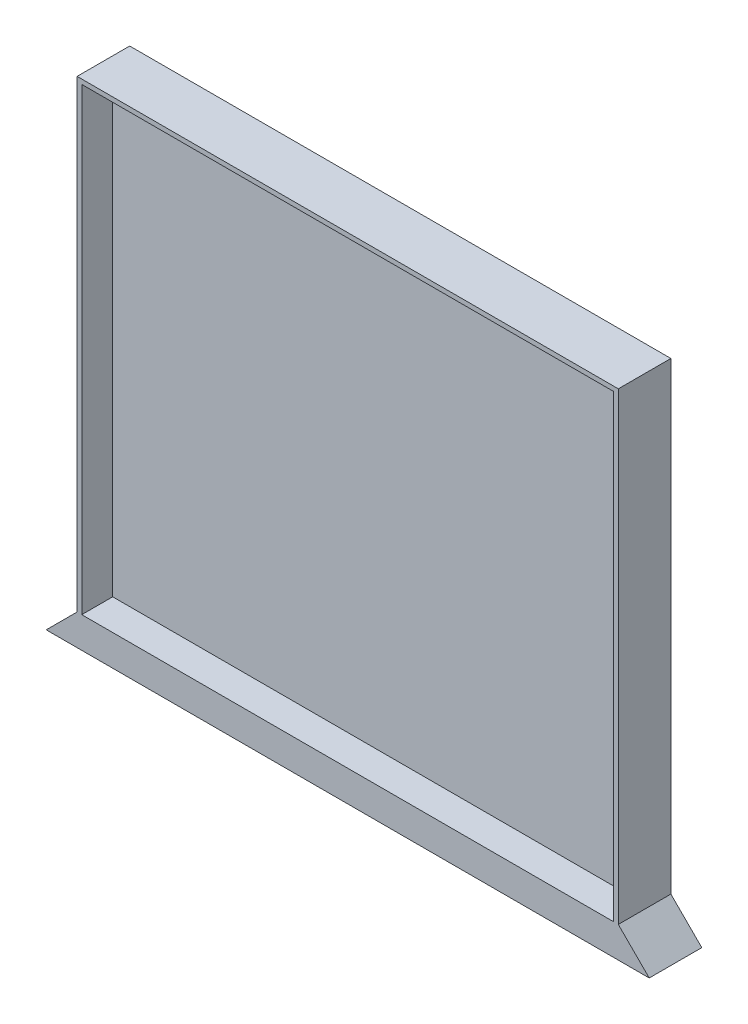
ISO-10303-21;
HEADER;
FILE_DESCRIPTION(('STEP AP214'),'2;1');
FILE_NAME('part.step','',(''),(''),'','','');
FILE_SCHEMA(('AUTOMOTIVE_DESIGN { 1 0 10303 214 1 1 1 1 }'));
ENDSEC;
DATA;
#1=APPLICATION_CONTEXT('core data for automotive mechanical design processes');
#2=APPLICATION_PROTOCOL_DEFINITION('international standard','automotive_design',2000,#1);
#3=PRODUCT_CONTEXT('',#1,'mechanical');
#4=PRODUCT('Part','Part','',(#3));
#5=PRODUCT_RELATED_PRODUCT_CATEGORY('part','',(#4));
#6=PRODUCT_DEFINITION_FORMATION('','',#4);
#7=PRODUCT_DEFINITION_CONTEXT('part definition',#1,'design');
#8=PRODUCT_DEFINITION('design','',#6,#7);
#9=PRODUCT_DEFINITION_SHAPE('','',#8);
#10=(LENGTH_UNIT() NAMED_UNIT(*) SI_UNIT(.MILLI.,.METRE.));
#11=(NAMED_UNIT(*) PLANE_ANGLE_UNIT() SI_UNIT($,.RADIAN.));
#12=(NAMED_UNIT(*) SI_UNIT($,.STERADIAN.) SOLID_ANGLE_UNIT());
#13=UNCERTAINTY_MEASURE_WITH_UNIT(LENGTH_MEASURE(1.E-05),#10,'distance_accuracy_value','');
#14=(GEOMETRIC_REPRESENTATION_CONTEXT(3) GLOBAL_UNCERTAINTY_ASSIGNED_CONTEXT((#13)) GLOBAL_UNIT_ASSIGNED_CONTEXT((#10,
#11,#12)) REPRESENTATION_CONTEXT('',''));
#15=CARTESIAN_POINT('',(0.,0.,0.));
#16=DIRECTION('',(0.,0.,1.));
#17=DIRECTION('',(1.,0.,0.));
#18=AXIS2_PLACEMENT_3D('',#15,#16,#17);
#19=CARTESIAN_POINT('',(175.,160.,34.));
#20=DIRECTION('',(-1.,0.,0.));
#21=DIRECTION('',(0.,0.,1.));
#22=AXIS2_PLACEMENT_3D('',#19,#20,#21);
#23=PLANE('',#22);
#24=DIRECTION('',(0.,0.,1.));
#25=VECTOR('',#24,1.);
#26=CARTESIAN_POINT('',(175.,-140.,34.));
#27=LINE('',#26,#25);
#28=CARTESIAN_POINT('',(175.,-140.,0.));
#29=VERTEX_POINT('',#28);
#30=CARTESIAN_POINT('',(175.,-140.,34.));
#31=VERTEX_POINT('',#30);
#32=EDGE_CURVE('E56',#29,#31,#27,.T.);
#33=ORIENTED_EDGE('',*,*,#32,.F.);
#34=DIRECTION('',(0.,1.,0.));
#35=VECTOR('',#34,1.);
#36=CARTESIAN_POINT('',(175.,160.,0.));
#37=LINE('',#36,#35);
#38=CARTESIAN_POINT('',(175.,160.,0.));
#39=VERTEX_POINT('',#38);
#40=EDGE_CURVE('E161',#29,#39,#37,.T.);
#41=ORIENTED_EDGE('',*,*,#40,.T.);
#42=DIRECTION('',(0.,0.,-1.));
#43=VECTOR('',#42,1.);
#44=CARTESIAN_POINT('',(175.,160.,34.));
#45=LINE('',#44,#43);
#46=CARTESIAN_POINT('',(175.,160.,34.));
#47=VERTEX_POINT('',#46);
#48=EDGE_CURVE('E178',#47,#39,#45,.T.);
#49=ORIENTED_EDGE('',*,*,#48,.F.);
#50=DIRECTION('',(0.,1.,0.));
#51=VECTOR('',#50,1.);
#52=CARTESIAN_POINT('',(175.,160.,34.));
#53=LINE('',#52,#51);
#54=EDGE_CURVE('E164',#31,#47,#53,.T.);
#55=ORIENTED_EDGE('',*,*,#54,.F.);
#56=EDGE_LOOP('',(#33,#41,#49,#55));
#57=FACE_BOUND('',#56,.T.);
#58=ADVANCED_FACE('F35',(#57),#23,.F.);
#59=CARTESIAN_POINT('',(-175.,160.,34.));
#60=DIRECTION('',(1.,0.,0.));
#61=DIRECTION('',(0.,1.,0.));
#62=AXIS2_PLACEMENT_3D('',#59,#60,#61);
#63=PLANE('',#62);
#64=DIRECTION('',(0.,0.,-1.));
#65=VECTOR('',#64,1.);
#66=CARTESIAN_POINT('',(-175.,-140.,34.));
#67=LINE('',#66,#65);
#68=CARTESIAN_POINT('',(-175.,-140.,34.));
#69=VERTEX_POINT('',#68);
#70=CARTESIAN_POINT('',(-175.,-140.,0.));
#71=VERTEX_POINT('',#70);
#72=EDGE_CURVE('E138',#69,#71,#67,.T.);
#73=ORIENTED_EDGE('',*,*,#72,.F.);
#74=DIRECTION('',(0.,-1.,0.));
#75=VECTOR('',#74,1.);
#76=CARTESIAN_POINT('',(-175.,160.,34.));
#77=LINE('',#76,#75);
#78=CARTESIAN_POINT('',(-175.,160.,34.));
#79=VERTEX_POINT('',#78);
#80=EDGE_CURVE('E122',#79,#69,#77,.T.);
#81=ORIENTED_EDGE('',*,*,#80,.F.);
#82=DIRECTION('',(0.,0.,-1.));
#83=VECTOR('',#82,1.);
#84=CARTESIAN_POINT('',(-175.,160.,34.));
#85=LINE('',#84,#83);
#86=CARTESIAN_POINT('',(-175.,160.,0.));
#87=VERTEX_POINT('',#86);
#88=EDGE_CURVE('E121',#79,#87,#85,.T.);
#89=ORIENTED_EDGE('',*,*,#88,.T.);
#90=DIRECTION('',(0.,-1.,0.));
#91=VECTOR('',#90,1.);
#92=CARTESIAN_POINT('',(-175.,160.,0.));
#93=LINE('',#92,#91);
#94=EDGE_CURVE('E172',#87,#71,#93,.T.);
#95=ORIENTED_EDGE('',*,*,#94,.T.);
#96=EDGE_LOOP('',(#73,#81,#89,#95));
#97=FACE_BOUND('',#96,.T.);
#98=ADVANCED_FACE('F192',(#97),#63,.F.);
#99=CARTESIAN_POINT('',(172.,157.,14.));
#100=DIRECTION('',(1.,0.,0.));
#101=DIRECTION('',(0.,0.,-1.));
#102=AXIS2_PLACEMENT_3D('',#99,#100,#101);
#103=PLANE('',#102);
#104=DIRECTION('',(0.,0.,-1.));
#105=VECTOR('',#104,1.);
#106=CARTESIAN_POINT('',(172.,-140.,14.));
#107=LINE('',#106,#105);
#108=CARTESIAN_POINT('',(172.,-140.,34.));
#109=VERTEX_POINT('',#108);
#110=CARTESIAN_POINT('',(172.,-140.,14.));
#111=VERTEX_POINT('',#110);
#112=EDGE_CURVE('E136',#109,#111,#107,.T.);
#113=ORIENTED_EDGE('',*,*,#112,.F.);
#114=DIRECTION('',(0.,1.,0.));
#115=VECTOR('',#114,1.);
#116=CARTESIAN_POINT('',(172.,157.,34.));
#117=LINE('',#116,#115);
#118=CARTESIAN_POINT('',(172.,157.,34.));
#119=VERTEX_POINT('',#118);
#120=EDGE_CURVE('E142',#109,#119,#117,.T.);
#121=ORIENTED_EDGE('',*,*,#120,.T.);
#122=DIRECTION('',(0.,0.,1.));
#123=VECTOR('',#122,1.);
#124=CARTESIAN_POINT('',(172.,157.,14.));
#125=LINE('',#124,#123);
#126=CARTESIAN_POINT('',(172.,157.,14.));
#127=VERTEX_POINT('',#126);
#128=EDGE_CURVE('E152',#127,#119,#125,.T.);
#129=ORIENTED_EDGE('',*,*,#128,.F.);
#130=DIRECTION('',(0.,1.,0.));
#131=VECTOR('',#130,1.);
#132=CARTESIAN_POINT('',(172.,157.,14.));
#133=LINE('',#132,#131);
#134=EDGE_CURVE('E143',#111,#127,#133,.T.);
#135=ORIENTED_EDGE('',*,*,#134,.F.);
#136=EDGE_LOOP('',(#113,#121,#129,#135));
#137=FACE_BOUND('',#136,.T.);
#138=ADVANCED_FACE('F210',(#137),#103,.F.);
#139=CARTESIAN_POINT('',(-172.,157.,14.));
#140=DIRECTION('',(-1.,0.,0.));
#141=DIRECTION('',(0.,0.,1.));
#142=AXIS2_PLACEMENT_3D('',#139,#140,#141);
#143=PLANE('',#142);
#144=DIRECTION('',(0.,0.,1.));
#145=VECTOR('',#144,1.);
#146=CARTESIAN_POINT('',(-172.,-140.,14.));
#147=LINE('',#146,#145);
#148=CARTESIAN_POINT('',(-172.,-140.,14.));
#149=VERTEX_POINT('',#148);
#150=CARTESIAN_POINT('',(-172.,-140.,34.));
#151=VERTEX_POINT('',#150);
#152=EDGE_CURVE('E134',#149,#151,#147,.T.);
#153=ORIENTED_EDGE('',*,*,#152,.F.);
#154=DIRECTION('',(0.,-1.,0.));
#155=VECTOR('',#154,1.);
#156=CARTESIAN_POINT('',(-172.,157.,14.));
#157=LINE('',#156,#155);
#158=CARTESIAN_POINT('',(-172.,157.,14.));
#159=VERTEX_POINT('',#158);
#160=EDGE_CURVE('E149',#159,#149,#157,.T.);
#161=ORIENTED_EDGE('',*,*,#160,.F.);
#162=DIRECTION('',(0.,0.,1.));
#163=VECTOR('',#162,1.);
#164=CARTESIAN_POINT('',(-172.,157.,14.));
#165=LINE('',#164,#163);
#166=CARTESIAN_POINT('',(-172.,157.,34.));
#167=VERTEX_POINT('',#166);
#168=EDGE_CURVE('E159',#159,#167,#165,.T.);
#169=ORIENTED_EDGE('',*,*,#168,.T.);
#170=DIRECTION('',(0.,-1.,0.));
#171=VECTOR('',#170,1.);
#172=CARTESIAN_POINT('',(-172.,157.,34.));
#173=LINE('',#172,#171);
#174=EDGE_CURVE('E146',#167,#151,#173,.T.);
#175=ORIENTED_EDGE('',*,*,#174,.T.);
#176=EDGE_LOOP('',(#153,#161,#169,#175));
#177=FACE_BOUND('',#176,.T.);
#178=ADVANCED_FACE('F227',(#177),#143,.F.);
#179=CARTESIAN_POINT('',(0.,0.,14.));
#180=DIRECTION('',(0.,0.,1.));
#181=DIRECTION('',(1.,0.,0.));
#182=AXIS2_PLACEMENT_3D('',#179,#180,#181);
#183=PLANE('',#182);
#184=ORIENTED_EDGE('',*,*,#160,.T.);
#185=DIRECTION('',(1.,0.,0.));
#186=VECTOR('',#185,1.);
#187=CARTESIAN_POINT('',(0.,-140.,14.));
#188=LINE('',#187,#186);
#189=EDGE_CURVE('E181',#149,#111,#188,.T.);
#190=ORIENTED_EDGE('',*,*,#189,.T.);
#191=ORIENTED_EDGE('',*,*,#134,.T.);
#192=DIRECTION('',(-1.,0.,0.));
#193=VECTOR('',#192,1.);
#194=CARTESIAN_POINT('',(-172.,157.,14.));
#195=LINE('',#194,#193);
#196=EDGE_CURVE('E145',#127,#159,#195,.T.);
#197=ORIENTED_EDGE('',*,*,#196,.T.);
#198=EDGE_LOOP('',(#184,#190,#191,#197));
#199=FACE_BOUND('',#198,.T.);
#200=ADVANCED_FACE('F215',(#199),#183,.T.);
#201=CARTESIAN_POINT('',(-175.,160.,34.));
#202=DIRECTION('',(0.,-1.,0.));
#203=DIRECTION('',(0.,0.,-1.));
#204=AXIS2_PLACEMENT_3D('',#201,#202,#203);
#205=PLANE('',#204);
#206=DIRECTION('',(-1.,0.,0.));
#207=VECTOR('',#206,1.);
#208=CARTESIAN_POINT('',(-175.,160.,0.));
#209=LINE('',#208,#207);
#210=EDGE_CURVE('E170',#39,#87,#209,.T.);
#211=ORIENTED_EDGE('',*,*,#210,.T.);
#212=ORIENTED_EDGE('',*,*,#88,.F.);
#213=DIRECTION('',(-1.,0.,0.));
#214=VECTOR('',#213,1.);
#215=CARTESIAN_POINT('',(-175.,160.,34.));
#216=LINE('',#215,#214);
#217=EDGE_CURVE('E166',#47,#79,#216,.T.);
#218=ORIENTED_EDGE('',*,*,#217,.F.);
#219=ORIENTED_EDGE('',*,*,#48,.T.);
#220=EDGE_LOOP('',(#211,#212,#218,#219));
#221=FACE_BOUND('',#220,.T.);
#222=ADVANCED_FACE('F213',(#221),#205,.F.);
#223=CARTESIAN_POINT('',(-175.,-160.,34.));
#224=DIRECTION('',(0.,1.,0.));
#225=DIRECTION('',(0.,0.,1.));
#226=AXIS2_PLACEMENT_3D('',#223,#224,#225);
#227=PLANE('',#226);
#228=DIRECTION('',(1.,0.,0.));
#229=VECTOR('',#228,1.);
#230=CARTESIAN_POINT('',(-175.,-160.,0.));
#231=LINE('',#230,#229);
#232=CARTESIAN_POINT('',(-195.,-160.,0.));
#233=VERTEX_POINT('',#232);
#234=CARTESIAN_POINT('',(195.,-160.,0.));
#235=VERTEX_POINT('',#234);
#236=EDGE_CURVE('E127',#233,#235,#231,.T.);
#237=ORIENTED_EDGE('',*,*,#236,.T.);
#238=DIRECTION('',(0.,0.,1.));
#239=VECTOR('',#238,1.);
#240=CARTESIAN_POINT('',(195.,-160.,34.));
#241=LINE('',#240,#239);
#242=CARTESIAN_POINT('',(195.,-160.,34.));
#243=VERTEX_POINT('',#242);
#244=EDGE_CURVE('E111',#235,#243,#241,.T.);
#245=ORIENTED_EDGE('',*,*,#244,.T.);
#246=DIRECTION('',(1.,0.,0.));
#247=VECTOR('',#246,1.);
#248=CARTESIAN_POINT('',(-175.,-160.,34.));
#249=LINE('',#248,#247);
#250=CARTESIAN_POINT('',(-195.,-160.,34.));
#251=VERTEX_POINT('',#250);
#252=EDGE_CURVE('E114',#251,#243,#249,.T.);
#253=ORIENTED_EDGE('',*,*,#252,.F.);
#254=DIRECTION('',(0.,0.,-1.));
#255=VECTOR('',#254,1.);
#256=CARTESIAN_POINT('',(-195.,-160.,34.));
#257=LINE('',#256,#255);
#258=EDGE_CURVE('E128',#251,#233,#257,.T.);
#259=ORIENTED_EDGE('',*,*,#258,.T.);
#260=EDGE_LOOP('',(#237,#245,#253,#259));
#261=FACE_BOUND('',#260,.T.);
#262=ADVANCED_FACE('F125',(#261),#227,.F.);
#263=CARTESIAN_POINT('',(0.,0.,34.));
#264=DIRECTION('',(0.,0.,1.));
#265=DIRECTION('',(1.,0.,0.));
#266=AXIS2_PLACEMENT_3D('',#263,#264,#265);
#267=PLANE('',#266);
#268=DIRECTION('',(-1.,0.,0.));
#269=VECTOR('',#268,1.);
#270=CARTESIAN_POINT('',(-195.,-140.,34.));
#271=LINE('',#270,#269);
#272=EDGE_CURVE('E130',#109,#151,#271,.T.);
#273=ORIENTED_EDGE('',*,*,#272,.T.);
#274=ORIENTED_EDGE('',*,*,#174,.F.);
#275=DIRECTION('',(-1.,0.,0.));
#276=VECTOR('',#275,1.);
#277=CARTESIAN_POINT('',(-172.,157.,34.));
#278=LINE('',#277,#276);
#279=EDGE_CURVE('E154',#119,#167,#278,.T.);
#280=ORIENTED_EDGE('',*,*,#279,.F.);
#281=ORIENTED_EDGE('',*,*,#120,.F.);
#282=EDGE_LOOP('',(#273,#274,#280,#281));
#283=FACE_BOUND('',#282,.T.);
#284=ORIENTED_EDGE('',*,*,#80,.T.);
#285=DIRECTION('',(-0.707106781186549,-0.707106781186546,0.));
#286=VECTOR('',#285,1.);
#287=CARTESIAN_POINT('',(-17.4999999999995,17.4999999999996,34.));
#288=LINE('',#287,#286);
#289=EDGE_CURVE('E11',#69,#251,#288,.T.);
#290=ORIENTED_EDGE('',*,*,#289,.T.);
#291=ORIENTED_EDGE('',*,*,#252,.T.);
#292=DIRECTION('',(-0.707106781186549,0.707106781186546,0.));
#293=VECTOR('',#292,1.);
#294=CARTESIAN_POINT('',(17.4999999999995,17.4999999999996,34.));
#295=LINE('',#294,#293);
#296=EDGE_CURVE('E43',#243,#31,#295,.T.);
#297=ORIENTED_EDGE('',*,*,#296,.T.);
#298=ORIENTED_EDGE('',*,*,#54,.T.);
#299=ORIENTED_EDGE('',*,*,#217,.T.);
#300=EDGE_LOOP('',(#284,#290,#291,#297,#298,#299));
#301=FACE_BOUND('',#300,.T.);
#302=ADVANCED_FACE('F116',(#283,#301),#267,.T.);
#303=CARTESIAN_POINT('',(0.,0.,0.));
#304=DIRECTION('',(0.,0.,1.));
#305=DIRECTION('',(1.,0.,0.));
#306=AXIS2_PLACEMENT_3D('',#303,#304,#305);
#307=PLANE('',#306);
#308=ORIENTED_EDGE('',*,*,#236,.F.);
#309=DIRECTION('',(0.707106781186549,0.707106781186546,0.));
#310=VECTOR('',#309,1.);
#311=CARTESIAN_POINT('',(-195.,-160.,0.));
#312=LINE('',#311,#310);
#313=EDGE_CURVE('E112',#233,#71,#312,.T.);
#314=ORIENTED_EDGE('',*,*,#313,.T.);
#315=ORIENTED_EDGE('',*,*,#94,.F.);
#316=ORIENTED_EDGE('',*,*,#210,.F.);
#317=ORIENTED_EDGE('',*,*,#40,.F.);
#318=DIRECTION('',(0.707106781186549,-0.707106781186546,0.));
#319=VECTOR('',#318,1.);
#320=CARTESIAN_POINT('',(195.,-160.,0.));
#321=LINE('',#320,#319);
#322=EDGE_CURVE('E184',#29,#235,#321,.T.);
#323=ORIENTED_EDGE('',*,*,#322,.T.);
#324=EDGE_LOOP('',(#308,#314,#315,#316,#317,#323));
#325=FACE_BOUND('',#324,.T.);
#326=ADVANCED_FACE('F188',(#325),#307,.F.);
#327=CARTESIAN_POINT('',(-172.,157.,14.));
#328=DIRECTION('',(0.,1.,0.));
#329=DIRECTION('',(0.,0.,1.));
#330=AXIS2_PLACEMENT_3D('',#327,#328,#329);
#331=PLANE('',#330);
#332=ORIENTED_EDGE('',*,*,#279,.T.);
#333=ORIENTED_EDGE('',*,*,#168,.F.);
#334=ORIENTED_EDGE('',*,*,#196,.F.);
#335=ORIENTED_EDGE('',*,*,#128,.T.);
#336=EDGE_LOOP('',(#332,#333,#334,#335));
#337=FACE_BOUND('',#336,.T.);
#338=ADVANCED_FACE('F202',(#337),#331,.F.);
#339=CARTESIAN_POINT('',(0.,-140.,0.));
#340=DIRECTION('',(0.,-1.,0.));
#341=DIRECTION('',(0.,0.,-1.));
#342=AXIS2_PLACEMENT_3D('',#339,#340,#341);
#343=PLANE('',#342);
#344=ORIENTED_EDGE('',*,*,#272,.F.);
#345=ORIENTED_EDGE('',*,*,#112,.T.);
#346=ORIENTED_EDGE('',*,*,#189,.F.);
#347=ORIENTED_EDGE('',*,*,#152,.T.);
#348=EDGE_LOOP('',(#344,#345,#346,#347));
#349=FACE_BOUND('',#348,.T.);
#350=ADVANCED_FACE('F197',(#349),#343,.F.);
#351=CARTESIAN_POINT('',(-195.,-160.,34.));
#352=DIRECTION('',(-0.707106781186545,0.707106781186549,0.));
#353=DIRECTION('',(0.,0.,1.));
#354=AXIS2_PLACEMENT_3D('',#351,#352,#353);
#355=PLANE('',#354);
#356=ORIENTED_EDGE('',*,*,#289,.F.);
#357=ORIENTED_EDGE('',*,*,#72,.T.);
#358=ORIENTED_EDGE('',*,*,#313,.F.);
#359=ORIENTED_EDGE('',*,*,#258,.F.);
#360=EDGE_LOOP('',(#356,#357,#358,#359));
#361=FACE_BOUND('',#360,.T.);
#362=ADVANCED_FACE('F195',(#361),#355,.T.);
#363=CARTESIAN_POINT('',(195.,-160.,34.));
#364=DIRECTION('',(0.707106781186545,0.707106781186549,0.));
#365=DIRECTION('',(0.,0.,-1.));
#366=AXIS2_PLACEMENT_3D('',#363,#364,#365);
#367=PLANE('',#366);
#368=ORIENTED_EDGE('',*,*,#322,.F.);
#369=ORIENTED_EDGE('',*,*,#32,.T.);
#370=ORIENTED_EDGE('',*,*,#296,.F.);
#371=ORIENTED_EDGE('',*,*,#244,.F.);
#372=EDGE_LOOP('',(#368,#369,#370,#371));
#373=FACE_BOUND('',#372,.T.);
#374=ADVANCED_FACE('F37',(#373),#367,.T.);
#375=CLOSED_SHELL('',(#58,#98,#138,#178,#200,#222,#262,#302,#326,#338,#350,#362,#374));
#376=MANIFOLD_SOLID_BREP('B2',#375);
#377=ADVANCED_BREP_SHAPE_REPRESENTATION('',(#18,#376),#14);
#378=SHAPE_DEFINITION_REPRESENTATION(#9,#377);
ENDSEC;
END-ISO-10303-21;
